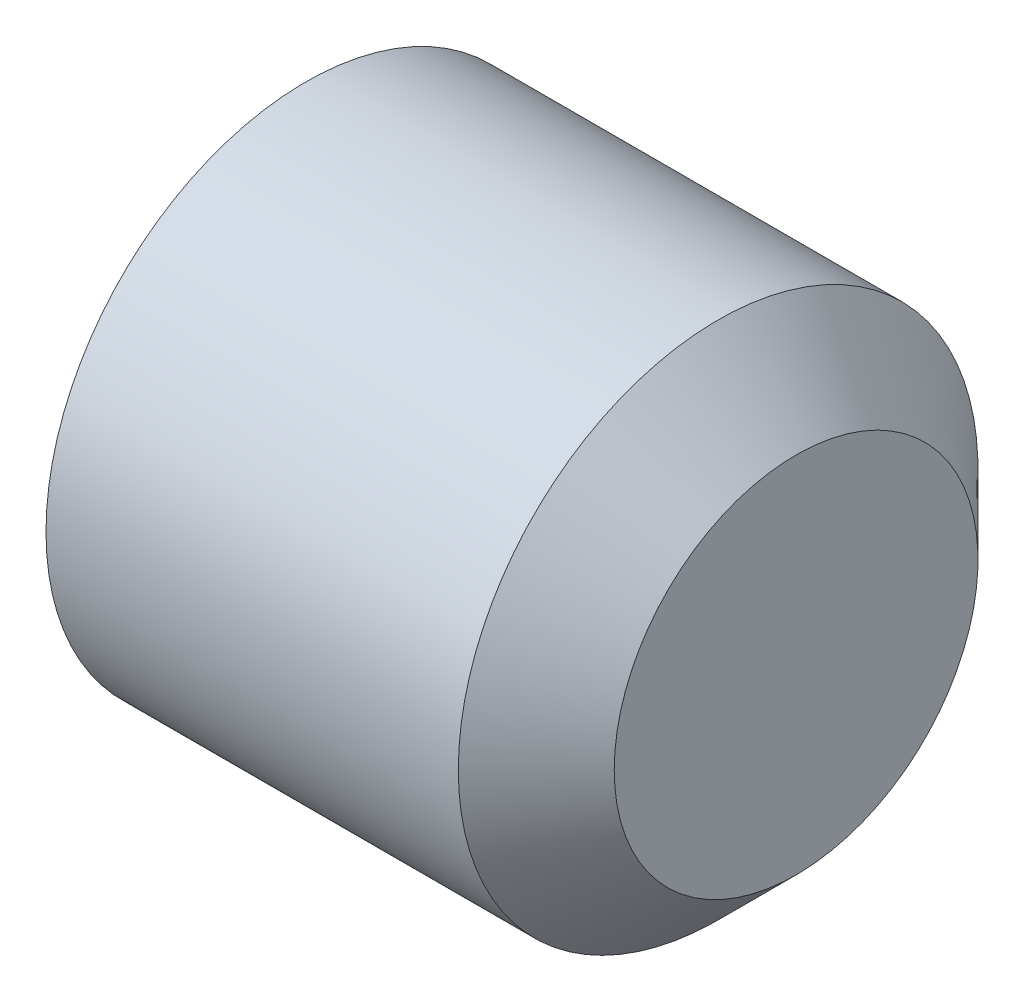
ISO-10303-21;
HEADER;
FILE_DESCRIPTION(('STEP AP214'),'2;1');
FILE_NAME('part.step','',(''),(''),'','','');
FILE_SCHEMA(('AUTOMOTIVE_DESIGN { 1 0 10303 214 1 1 1 1 }'));
ENDSEC;
DATA;
#1=APPLICATION_CONTEXT('core data for automotive mechanical design processes');
#2=APPLICATION_PROTOCOL_DEFINITION('international standard','automotive_design',2000,#1);
#3=PRODUCT_CONTEXT('',#1,'mechanical');
#4=PRODUCT('Part','Part','',(#3));
#5=PRODUCT_RELATED_PRODUCT_CATEGORY('part','',(#4));
#6=PRODUCT_DEFINITION_FORMATION('','',#4);
#7=PRODUCT_DEFINITION_CONTEXT('part definition',#1,'design');
#8=PRODUCT_DEFINITION('design','',#6,#7);
#9=PRODUCT_DEFINITION_SHAPE('','',#8);
#10=(LENGTH_UNIT() NAMED_UNIT(*) SI_UNIT(.MILLI.,.METRE.));
#11=(NAMED_UNIT(*) PLANE_ANGLE_UNIT() SI_UNIT($,.RADIAN.));
#12=(NAMED_UNIT(*) SI_UNIT($,.STERADIAN.) SOLID_ANGLE_UNIT());
#13=UNCERTAINTY_MEASURE_WITH_UNIT(LENGTH_MEASURE(1.E-05),#10,'distance_accuracy_value','');
#14=(GEOMETRIC_REPRESENTATION_CONTEXT(3) GLOBAL_UNCERTAINTY_ASSIGNED_CONTEXT((#13)) GLOBAL_UNIT_ASSIGNED_CONTEXT((#10,
#11,#12)) REPRESENTATION_CONTEXT('',''));
#15=CARTESIAN_POINT('',(0.,0.,0.));
#16=DIRECTION('',(0.,0.,1.));
#17=DIRECTION('',(1.,0.,0.));
#18=AXIS2_PLACEMENT_3D('',#15,#16,#17);
#19=CARTESIAN_POINT('',(0.83333333333333,0.,0.));
#20=DIRECTION('',(-1.,0.,0.));
#21=DIRECTION('',(0.,0.,1.));
#22=AXIS2_PLACEMENT_3D('',#19,#20,#21);
#23=CONICAL_SURFACE('',#22,0.,1.04719755119661);
#24=CARTESIAN_POINT('',(0.,0.,0.));
#25=DIRECTION('',(-1.,0.,0.));
#26=DIRECTION('',(0.,0.,1.));
#27=AXIS2_PLACEMENT_3D('',#24,#25,#26);
#28=CIRCLE('',#27,1.4433756729741);
#29=CARTESIAN_POINT('',(0.,0.,1.4433756729741));
#30=VERTEX_POINT('',#29);
#31=CARTESIAN_POINT('',(0.,1.25000000000003,0.721687836487051));
#32=VERTEX_POINT('',#31);
#33=EDGE_CURVE('E142',#30,#32,#28,.T.);
#34=ORIENTED_EDGE('',*,*,#33,.T.);
#35=CARTESIAN_POINT('',(-6.66746660219313E-05,1.25020000000002,0.721572366433221));
#36=CARTESIAN_POINT('',(0.0182540852363146,1.19526669476825,0.753288124996257));
#37=CARTESIAN_POINT('',(0.0349166937993671,1.13985921349977,0.78527764922173));
#38=CARTESIAN_POINT('',(0.0640026960542333,1.02808463239967,0.849810733708432));
#39=CARTESIAN_POINT('',(0.0764157980239526,0.971715545158301,0.882355441401211));
#40=CARTESIAN_POINT('',(0.0957403123639898,0.859676025913025,0.947041487997347));
#41=CARTESIAN_POINT('',(0.102780310552569,0.804022841540779,0.979172868975923));
#42=CARTESIAN_POINT('',(0.111187567369367,0.692454346091615,1.04358696985658));
#43=CARTESIAN_POINT('',(0.112561784795276,0.636539441062406,1.07586945532691));
#44=CARTESIAN_POINT('',(0.109716662632079,0.532042078818279,1.13620103554816));
#45=CARTESIAN_POINT('',(0.106195901179983,0.483444050118688,1.16425912049995));
#46=CARTESIAN_POINT('',(0.0950328873007429,0.386564637826765,1.22019247526563));
#47=CARTESIAN_POINT('',(0.0873868144273217,0.33828358980784,1.24806755133611));
#48=CARTESIAN_POINT('',(0.0682705452994674,0.241204116145959,1.30411641158758));
#49=CARTESIAN_POINT('',(0.0567192430203415,0.192417989648102,1.33228309485384));
#50=CARTESIAN_POINT('',(0.0305016853061078,0.095573747707899,1.38819614400748));
#51=CARTESIAN_POINT('',(0.0158415978608937,0.0475143896730363,1.41594322730599));
#52=CARTESIAN_POINT('',(-6.66746660267736E-05,-0.000200000000000035,1.44349114302794));
#53=B_SPLINE_CURVE_WITH_KNOTS('',3,(#35,#36,#37,#38,#39,#40,#41,#42,#43,#44,#45,#46,#47,#48,#49,
#50,#51,#52),.UNSPECIFIED.,.F.,.F.,(4,2,2,2,2,2,2,2,4),(0.,0.198150821029562,0.396778196315227,
0.590488617354409,0.783961049317194,0.95248005639866,1.12115539730011,1.29357430343591,
1.46565426976932),.UNSPECIFIED.);
#54=EDGE_CURVE('E11',#32,#30,#53,.T.);
#55=ORIENTED_EDGE('',*,*,#54,.T.);
#56=EDGE_LOOP('',(#34,#55));
#57=FACE_BOUND('',#56,.T.);
#58=ADVANCED_FACE('F43',(#57),#23,.F.);
#59=CARTESIAN_POINT('',(0.,-1.25000000000002,0.721687836487058));
#60=VERTEX_POINT('',#59);
#61=EDGE_CURVE('E141',#60,#30,#28,.T.);
#62=ORIENTED_EDGE('',*,*,#61,.T.);
#63=CARTESIAN_POINT('',(-6.66746660268099E-05,0.000199999999999981,1.44349114302794));
#64=CARTESIAN_POINT('',(0.0182540852363098,-0.0547333052317663,1.4117753844649));
#65=CARTESIAN_POINT('',(0.0349166937993627,-0.110140786500242,1.37978586023943));
#66=CARTESIAN_POINT('',(0.06400269605423,-0.221915367600345,1.31525277575273));
#67=CARTESIAN_POINT('',(0.0764157980239499,-0.278284454841716,1.28270806805995));
#68=CARTESIAN_POINT('',(0.0957403123639879,-0.390323974086993,1.21802202146381));
#69=CARTESIAN_POINT('',(0.102780310552568,-0.445977158459239,1.18589064048523));
#70=CARTESIAN_POINT('',(0.111187567369366,-0.557545653908403,1.12147653960458));
#71=CARTESIAN_POINT('',(0.112561784795275,-0.613460558937613,1.08919405413425));
#72=CARTESIAN_POINT('',(0.10971666263208,-0.717957921181739,1.028862473913));
#73=CARTESIAN_POINT('',(0.106195901179984,-0.76655594988133,1.0008043889612));
#74=CARTESIAN_POINT('',(0.0950328873007448,-0.863435362173253,0.94487103419553));
#75=CARTESIAN_POINT('',(0.087386814427324,-0.911716410192178,0.916995958125047));
#76=CARTESIAN_POINT('',(0.0682705452994706,-1.00879588385406,0.860947097873573));
#77=CARTESIAN_POINT('',(0.0567192430203451,-1.05758201035191,0.832780414607316));
#78=CARTESIAN_POINT('',(0.0305016853061119,-1.15442625229212,0.776867365453675));
#79=CARTESIAN_POINT('',(0.0158415978608981,-1.20248561032698,0.749120282155167));
#80=CARTESIAN_POINT('',(-6.66746660219481E-05,-1.25020000000002,0.721572366433221));
#81=B_SPLINE_CURVE_WITH_KNOTS('',3,(#63,#64,#65,#66,#67,#68,#69,#70,#71,#72,#73,#74,#75,#76,#77,
#78,#79,#80),.UNSPECIFIED.,.F.,.F.,(4,2,2,2,2,2,2,2,4),(0.,0.198150821029564,0.396778196315229,
0.590488617354412,0.783961049317198,0.952480056398663,1.12115539730011,1.29357430343592,
1.46565426976932),.UNSPECIFIED.);
#82=EDGE_CURVE('E57',#30,#60,#81,.T.);
#83=ORIENTED_EDGE('',*,*,#82,.T.);
#84=EDGE_LOOP('',(#62,#83));
#85=FACE_BOUND('',#84,.T.);
#86=ADVANCED_FACE('F217',(#85),#23,.F.);
#87=CARTESIAN_POINT('',(0.,-1.25000000000002,-0.721687836487002));
#88=VERTEX_POINT('',#87);
#89=EDGE_CURVE('E245',#88,#60,#28,.T.);
#90=ORIENTED_EDGE('',*,*,#89,.T.);
#91=CARTESIAN_POINT('',(-0.723125533725218,-1.25000000000002,2.38855450315372));
#92=CARTESIAN_POINT('',(-0.694512714136866,-1.25000000000002,2.33261400232343));
#93=CARTESIAN_POINT('',(-0.66606638488083,-1.25000000000002,2.27658784489106));
#94=CARTESIAN_POINT('',(-0.609585913438912,-1.25000000000002,2.16432677662066));
#95=CARTESIAN_POINT('',(-0.581551780027691,-1.25000000000002,2.10809186137049));
#96=CARTESIAN_POINT('',(-0.498093498263183,-1.25000000000002,1.93882910957217));
#97=CARTESIAN_POINT('',(-0.443411639249018,-1.25000000000002,1.82543388021049));
#98=CARTESIAN_POINT('',(-0.334298848658163,-1.25000000000002,1.59142958961822));
#99=CARTESIAN_POINT('',(-0.280022481335802,-1.25000000000002,1.47074722047899));
#100=CARTESIAN_POINT('',(-0.202661005486305,-1.25000000000002,1.28803679596571));
#101=CARTESIAN_POINT('',(-0.177555163940496,-1.25000000000002,1.22686777081667));
#102=CARTESIAN_POINT('',(-0.129115153823104,-1.25000000000002,1.10383524784599));
#103=CARTESIAN_POINT('',(-0.105780807369272,-1.25000000000002,1.04197182046975));
#104=CARTESIAN_POINT('',(-0.0574567956154591,-1.25000000000002,0.906290686389106));
#105=CARTESIAN_POINT('',(-0.0329155229053761,-1.25000000000002,0.832310829015467));
#106=CARTESIAN_POINT('',(0.0117528005591605,-1.25000000000002,0.683045282747963));
#107=CARTESIAN_POINT('',(0.0318821801489908,-1.25000000000002,0.607760305524386));
#108=CARTESIAN_POINT('',(0.0658999098953772,-1.25000000000002,0.457227311030485));
#109=CARTESIAN_POINT('',(0.0798975032663708,-1.25000000000002,0.382004714348821));
#110=CARTESIAN_POINT('',(0.100694509672485,-1.25000000000002,0.230574793536791));
#111=CARTESIAN_POINT('',(0.107497972399627,-1.25000000000002,0.154368047882492));
#112=CARTESIAN_POINT('',(0.113017067627266,-1.25000000000002,0.000758127504506175));
#113=CARTESIAN_POINT('',(0.111637545538924,-1.25000000000002,-0.0766486420869878));
#114=CARTESIAN_POINT('',(0.100772950050972,-1.25000000000002,-0.230894929107457));
#115=CARTESIAN_POINT('',(0.0912846749924727,-1.25000000000002,-0.307734210380375));
#116=CARTESIAN_POINT('',(0.0651909747562643,-1.25000000000002,-0.461702943031744));
#117=CARTESIAN_POINT('',(0.0484494878936388,-1.25000000000002,-0.538808478119655));
#118=CARTESIAN_POINT('',(0.00949941464194663,-1.25000000000002,-0.691605492713038));
#119=CARTESIAN_POINT('',(-0.0127104303057358,-1.25000000000002,-0.767296642372799));
#120=CARTESIAN_POINT('',(-0.0591758290557663,-1.25000000000002,-0.91131122625957));
#121=CARTESIAN_POINT('',(-0.0831218497054745,-1.25000000000002,-0.979736466805027));
#122=CARTESIAN_POINT('',(-0.133531682963292,-1.25000000000002,-1.11565965802141));
#123=CARTESIAN_POINT('',(-0.159995993229588,-1.25000000000002,-1.18315742237818));
#124=CARTESIAN_POINT('',(-0.214822951192086,-1.25000000000002,-1.31744060643002));
#125=CARTESIAN_POINT('',(-0.243187240234055,-1.25000000000002,-1.38422535089341));
#126=CARTESIAN_POINT('',(-0.301338794191647,-1.25000000000002,-1.51717422229082));
#127=CARTESIAN_POINT('',(-0.331126152263779,-1.25000000000002,-1.58333830825537));
#128=CARTESIAN_POINT('',(-0.418871668434598,-1.25000000000002,-1.77405787301153));
#129=CARTESIAN_POINT('',(-0.478222830298611,-1.25000000000002,-1.89797140255541));
#130=CARTESIAN_POINT('',(-0.568973030237184,-1.25000000000002,-2.08276459736176));
#131=CARTESIAN_POINT('',(-0.59946560514473,-1.25000000000002,-2.14409605852878));
#132=CARTESIAN_POINT('',(-0.660947546416482,-1.25000000000002,-2.26650353643493));
#133=CARTESIAN_POINT('',(-0.691936873120399,-1.25000000000002,-2.32757957308086));
#134=CARTESIAN_POINT('',(-0.723125533725189,-1.25000000000002,-2.38855450315366));
#135=B_SPLINE_CURVE_WITH_KNOTS('',3,(#91,#92,#93,#94,#95,#96,#97,#98,#99,#100,#101,#102,#103,
#104,#105,#106,#107,#108,#109,#110,#111,#112,#113,#114,#115,#116,#117,#118,#119,#120,#121,#122,
#123,#124,#125,#126,#127,#128,#129,#130,#131,#132,#133,#134),.UNSPECIFIED.,.F.,.F.,(4,2,2,2,2,2,
2,2,2,2,2,2,2,2,2,2,2,2,2,2,2,4),(0.,0.188500396101583,0.377004799132287,0.754656745053071,
1.15153907639069,1.3498805083985,1.54820199780876,1.78193522701242,2.0155447804655,
2.24480392033555,2.47393393772945,2.70573354165869,2.93762471161865,3.17406818753763,
3.41056613256657,3.62798696703794,3.84545085726258,4.06310509441107,4.28077359915012,
4.69290371598787,4.8983831803543,5.10384632030758),.UNSPECIFIED.);
#136=EDGE_CURVE('E191',#60,#88,#135,.T.);
#137=ORIENTED_EDGE('',*,*,#136,.T.);
#138=EDGE_LOOP('',(#90,#137));
#139=FACE_BOUND('',#138,.T.);
#140=ADVANCED_FACE('F223',(#139),#23,.F.);
#141=CARTESIAN_POINT('',(0.,0.,-1.44337567297404));
#142=VERTEX_POINT('',#141);
#143=EDGE_CURVE('E243',#142,#88,#28,.T.);
#144=ORIENTED_EDGE('',*,*,#143,.T.);
#145=CARTESIAN_POINT('',(-6.66746660057022E-05,-1.25020000000002,-0.721572366433164));
#146=CARTESIAN_POINT('',(0.0182540852363312,-1.19526669476825,-0.753288124996199));
#147=CARTESIAN_POINT('',(0.0349166937993845,-1.13985921349978,-0.785277649221672));
#148=CARTESIAN_POINT('',(0.0640026960542528,-1.02808463239968,-0.849810733708372));
#149=CARTESIAN_POINT('',(0.0764157980239733,-0.971715545158308,-0.882355441401151));
#150=CARTESIAN_POINT('',(0.0957403123640127,-0.859676025913034,-0.947041487997285));
#151=CARTESIAN_POINT('',(0.102780310552593,-0.80402284154079,-0.979172868975861));
#152=CARTESIAN_POINT('',(0.111187567369394,-0.692454346091628,-1.04358696985652));
#153=CARTESIAN_POINT('',(0.112561784795304,-0.63653944106242,-1.07586945532684));
#154=CARTESIAN_POINT('',(0.10971666263211,-0.532042078818294,-1.13620103554809));
#155=CARTESIAN_POINT('',(0.106195901180015,-0.483444050118702,-1.16425912049989));
#156=CARTESIAN_POINT('',(0.0950328873007757,-0.386564637826775,-1.22019247526556));
#157=CARTESIAN_POINT('',(0.087386814427355,-0.338283589807849,-1.24806755133605));
#158=CARTESIAN_POINT('',(0.0682705452995012,-0.241204116145966,-1.30411641158752));
#159=CARTESIAN_POINT('',(0.0567192430203753,-0.192417989648107,-1.33228309485378));
#160=CARTESIAN_POINT('',(0.0305016853061413,-0.0955737477079013,-1.38819614400743));
#161=CARTESIAN_POINT('',(0.0158415978609268,-0.0475143896730374,-1.41594322730593));
#162=CARTESIAN_POINT('',(-6.66746659940686E-05,0.000200000000000096,-1.44349114302788));
#163=B_SPLINE_CURVE_WITH_KNOTS('',3,(#145,#146,#147,#148,#149,#150,#151,#152,#153,#154,#155,
#156,#157,#158,#159,#160,#161,#162),.UNSPECIFIED.,.F.,.F.,(4,2,2,2,2,2,2,2,4),(0.,
0.198150821029559,0.396778196315219,0.590488617354397,0.783961049317178,0.952480056398648,
1.1211553973001,1.29357430343591,1.46565426976932),.UNSPECIFIED.);
#164=EDGE_CURVE('E185',#88,#142,#163,.T.);
#165=ORIENTED_EDGE('',*,*,#164,.T.);
#166=EDGE_LOOP('',(#144,#165));
#167=FACE_BOUND('',#166,.T.);
#168=ADVANCED_FACE('F234',(#167),#23,.F.);
#169=CARTESIAN_POINT('',(0.,1.25000000000002,-0.721687836487002));
#170=VERTEX_POINT('',#169);
#171=EDGE_CURVE('E241',#170,#142,#28,.T.);
#172=ORIENTED_EDGE('',*,*,#171,.T.);
#173=CARTESIAN_POINT('',(-6.66746659941212E-05,-0.000199999999999926,-1.44349114302788));
#174=CARTESIAN_POINT('',(0.0182540852363418,0.0547333052317643,-1.41177538446485));
#175=CARTESIAN_POINT('',(0.034916693799394,0.110140786500238,-1.37978586023937));
#176=CARTESIAN_POINT('',(0.0640026960542601,0.221915367600336,-1.31525277575267));
#177=CARTESIAN_POINT('',(0.0764157980239795,0.278284454841706,-1.2827080680599));
#178=CARTESIAN_POINT('',(0.0957403123640169,0.390323974086978,-1.21802202146376));
#179=CARTESIAN_POINT('',(0.102780310552596,0.445977158459222,-1.18589064048519));
#180=CARTESIAN_POINT('',(0.111187567369395,0.557545653908382,-1.12147653960453));
#181=CARTESIAN_POINT('',(0.112561784795304,0.613460558937589,-1.08919405413421));
#182=CARTESIAN_POINT('',(0.109716662632108,0.717957921181716,-1.02886247391296));
#183=CARTESIAN_POINT('',(0.106195901180012,0.766555949881308,-1.00080438896116));
#184=CARTESIAN_POINT('',(0.0950328873007713,0.863435362173236,-0.944871034195484));
#185=CARTESIAN_POINT('',(0.0873868144273497,0.911716410192163,-0.916995958124999));
#186=CARTESIAN_POINT('',(0.0682705452994941,1.00879588385405,-0.860947097873523));
#187=CARTESIAN_POINT('',(0.0567192430203673,1.05758201035191,-0.832780414607265));
#188=CARTESIAN_POINT('',(0.0305016853061314,1.15442625229211,-0.776867365453621));
#189=CARTESIAN_POINT('',(0.015841597860916,1.20248561032698,-0.749120282155111));
#190=CARTESIAN_POINT('',(-6.66746660057401E-05,1.25020000000002,-0.721572366433164));
#191=B_SPLINE_CURVE_WITH_KNOTS('',3,(#173,#174,#175,#176,#177,#178,#179,#180,#181,#182,#183,
#184,#185,#186,#187,#188,#189,#190),.UNSPECIFIED.,.F.,.F.,(4,2,2,2,2,2,2,2,4),(0.,
0.198150821029556,0.396778196315213,0.590488617354389,0.783961049317167,0.952480056398639,
1.1211553973001,1.29357430343591,1.46565426976932),.UNSPECIFIED.);
#192=EDGE_CURVE('E124',#142,#170,#191,.T.);
#193=ORIENTED_EDGE('',*,*,#192,.T.);
#194=EDGE_LOOP('',(#172,#193));
#195=FACE_BOUND('',#194,.T.);
#196=ADVANCED_FACE('F226',(#195),#23,.F.);
#197=EDGE_CURVE('E146',#32,#170,#28,.T.);
#198=ORIENTED_EDGE('',*,*,#197,.T.);
#199=CARTESIAN_POINT('',(-0.72312553372519,1.25000000000002,-2.38855450315366));
#200=CARTESIAN_POINT('',(-0.694512714136838,1.25000000000002,-2.33261400232338));
#201=CARTESIAN_POINT('',(-0.666066384880803,1.25000000000002,-2.27658784489101));
#202=CARTESIAN_POINT('',(-0.609585913438887,1.25000000000002,-2.16432677662061));
#203=CARTESIAN_POINT('',(-0.581551780027666,1.25000000000002,-2.10809186137044));
#204=CARTESIAN_POINT('',(-0.49809349826316,1.25000000000002,-1.93882910957213));
#205=CARTESIAN_POINT('',(-0.443411639248997,1.25000000000002,-1.82543388021045));
#206=CARTESIAN_POINT('',(-0.334298848658144,1.25000000000002,-1.59142958961817));
#207=CARTESIAN_POINT('',(-0.280022481335785,1.25000000000002,-1.47074722047895));
#208=CARTESIAN_POINT('',(-0.20266100548629,1.25000000000002,-1.28803679596567));
#209=CARTESIAN_POINT('',(-0.177555163940482,1.25000000000002,-1.22686777081664));
#210=CARTESIAN_POINT('',(-0.129115153823092,1.25000000000002,-1.10383524784596));
#211=CARTESIAN_POINT('',(-0.105780807369261,1.25000000000002,-1.04197182046972));
#212=CARTESIAN_POINT('',(-0.0574567956154493,1.25000000000002,-0.906290686389077));
#213=CARTESIAN_POINT('',(-0.0329155229053671,1.25000000000002,-0.832310829015439));
#214=CARTESIAN_POINT('',(0.0117528005591679,1.25000000000002,-0.683045282747935));
#215=CARTESIAN_POINT('',(0.0318821801489975,1.25000000000002,-0.607760305524359));
#216=CARTESIAN_POINT('',(0.0658999098953822,1.25000000000002,-0.45722731103046));
#217=CARTESIAN_POINT('',(0.0798975032663748,1.25000000000002,-0.382004714348796));
#218=CARTESIAN_POINT('',(0.100694509672488,1.25000000000002,-0.230574793536767));
#219=CARTESIAN_POINT('',(0.107497972399629,1.25000000000002,-0.154368047882468));
#220=CARTESIAN_POINT('',(0.113017067627266,1.25000000000002,-0.000758127504484545));
#221=CARTESIAN_POINT('',(0.111637545538924,1.25000000000002,0.0766486420870085));
#222=CARTESIAN_POINT('',(0.10077295005097,1.25000000000002,0.230894929107476));
#223=CARTESIAN_POINT('',(0.0912846749924701,1.25000000000002,0.307734210380393));
#224=CARTESIAN_POINT('',(0.0651909747562611,1.25000000000002,0.46170294303176));
#225=CARTESIAN_POINT('',(0.0484494878936356,1.25000000000002,0.53880847811967));
#226=CARTESIAN_POINT('',(0.0094994146419431,1.25000000000002,0.691605492713051));
#227=CARTESIAN_POINT('',(-0.0127104303057395,1.25000000000002,0.767296642372811));
#228=CARTESIAN_POINT('',(-0.0591758290557709,1.25000000000002,0.911311226259583));
#229=CARTESIAN_POINT('',(-0.08312184970548,1.25000000000002,0.979736466805042));
#230=CARTESIAN_POINT('',(-0.1335316829633,1.25000000000002,1.11565965802143));
#231=CARTESIAN_POINT('',(-0.159995993229597,1.25000000000002,1.1831574223782));
#232=CARTESIAN_POINT('',(-0.214822951192096,1.25000000000002,1.31744060643004));
#233=CARTESIAN_POINT('',(-0.243187240234067,1.25000000000002,1.38422535089344));
#234=CARTESIAN_POINT('',(-0.301338794191661,1.25000000000002,1.51717422229085));
#235=CARTESIAN_POINT('',(-0.331126152263794,1.25000000000002,1.5833383082554));
#236=CARTESIAN_POINT('',(-0.418871668434616,1.25000000000002,1.77405787301157));
#237=CARTESIAN_POINT('',(-0.478222830298631,1.25000000000002,1.89797140255546));
#238=CARTESIAN_POINT('',(-0.568973030237207,1.25000000000002,2.0827645973618));
#239=CARTESIAN_POINT('',(-0.599465605144755,1.25000000000002,2.14409605852883));
#240=CARTESIAN_POINT('',(-0.660947546416509,1.25000000000002,2.26650353643498));
#241=CARTESIAN_POINT('',(-0.691936873120427,1.25000000000002,2.32757957308092));
#242=CARTESIAN_POINT('',(-0.723125533725218,1.25000000000002,2.38855450315372));
#243=B_SPLINE_CURVE_WITH_KNOTS('',3,(#199,#200,#201,#202,#203,#204,#205,#206,#207,#208,#209,
#210,#211,#212,#213,#214,#215,#216,#217,#218,#219,#220,#221,#222,#223,#224,#225,#226,#227,#228,
#229,#230,#231,#232,#233,#234,#235,#236,#237,#238,#239,#240,#241,#242),.UNSPECIFIED.,.F.,.F.,(4,
2,2,2,2,2,2,2,2,2,2,2,2,2,2,2,2,2,2,2,2,4),(0.,0.188500396101579,0.377004799132279,
0.754656745053056,1.15153907639067,1.34988050839847,1.54820199780873,1.78193522701238,
2.01554478046546,2.24480392033551,2.47393393772941,2.70573354165865,2.93762471161861,
3.17406818753758,3.41056613256652,3.62798696703789,3.84545085726254,4.06310509441104,
4.28077359915009,4.69290371598786,4.89838318035429,5.10384632030758),.UNSPECIFIED.);
#244=EDGE_CURVE('E90',#170,#32,#243,.T.);
#245=ORIENTED_EDGE('',*,*,#244,.T.);
#246=EDGE_LOOP('',(#198,#245));
#247=FACE_BOUND('',#246,.T.);
#248=ADVANCED_FACE('F219',(#247),#23,.F.);
#249=CARTESIAN_POINT('',(5.,0.,0.));
#250=DIRECTION('',(1.,0.,0.));
#251=DIRECTION('',(0.,0.,-1.));
#252=AXIS2_PLACEMENT_3D('',#249,#250,#251);
#253=PLANE('',#252);
#254=CARTESIAN_POINT('',(5.,0.,0.));
#255=DIRECTION('',(-1.,0.,0.));
#256=DIRECTION('',(0.,0.,1.));
#257=AXIS2_PLACEMENT_3D('',#254,#255,#256);
#258=CIRCLE('',#257,1.75);
#259=CARTESIAN_POINT('',(5.,0.,1.75));
#260=VERTEX_POINT('',#259);
#261=EDGE_CURVE('E155',#260,#260,#258,.T.);
#262=ORIENTED_EDGE('',*,*,#261,.F.);
#263=EDGE_LOOP('',(#262));
#264=FACE_BOUND('',#263,.T.);
#265=ADVANCED_FACE('F45',(#264),#253,.T.);
#266=CARTESIAN_POINT('',(4.25,0.,0.));
#267=DIRECTION('',(-1.,0.,0.));
#268=DIRECTION('',(0.,0.,1.));
#269=AXIS2_PLACEMENT_3D('',#266,#267,#268);
#270=CONICAL_SURFACE('',#269,2.5,0.785398163397449);
#271=ORIENTED_EDGE('',*,*,#261,.T.);
#272=EDGE_LOOP('',(#271));
#273=FACE_BOUND('',#272,.T.);
#274=CARTESIAN_POINT('',(4.25,0.,0.));
#275=DIRECTION('',(-1.,0.,0.));
#276=DIRECTION('',(0.,0.,1.));
#277=AXIS2_PLACEMENT_3D('',#274,#275,#276);
#278=CIRCLE('',#277,2.5);
#279=CARTESIAN_POINT('',(4.25,0.,2.5));
#280=VERTEX_POINT('',#279);
#281=EDGE_CURVE('E152',#280,#280,#278,.T.);
#282=ORIENTED_EDGE('',*,*,#281,.F.);
#283=EDGE_LOOP('',(#282));
#284=FACE_BOUND('',#283,.T.);
#285=ADVANCED_FACE('F232',(#273,#284),#270,.T.);
#286=CARTESIAN_POINT('',(0.83333333333333,0.,0.));
#287=DIRECTION('',(-1.,0.,0.));
#288=DIRECTION('',(0.,0.,1.));
#289=AXIS2_PLACEMENT_3D('',#286,#287,#288);
#290=CYLINDRICAL_SURFACE('',#289,2.5);
#291=ORIENTED_EDGE('',*,*,#281,.T.);
#292=EDGE_LOOP('',(#291));
#293=FACE_BOUND('',#292,.T.);
#294=CARTESIAN_POINT('',(0.28319030703751,0.,0.));
#295=DIRECTION('',(-1.,0.,0.));
#296=DIRECTION('',(0.,0.,1.));
#297=AXIS2_PLACEMENT_3D('',#294,#295,#296);
#298=CIRCLE('',#297,2.5);
#299=CARTESIAN_POINT('',(0.28319030703751,0.,2.5));
#300=VERTEX_POINT('',#299);
#301=EDGE_CURVE('E149',#300,#300,#298,.T.);
#302=ORIENTED_EDGE('',*,*,#301,.F.);
#303=EDGE_LOOP('',(#302));
#304=FACE_BOUND('',#303,.T.);
#305=ADVANCED_FACE('F283',(#293,#304),#290,.T.);
#306=CARTESIAN_POINT('',(0.,0.,0.));
#307=DIRECTION('',(1.,0.,0.));
#308=DIRECTION('',(0.,0.,-1.));
#309=AXIS2_PLACEMENT_3D('',#306,#307,#308);
#310=CONICAL_SURFACE('',#309,2.0095,1.0471975511966);
#311=ORIENTED_EDGE('',*,*,#301,.T.);
#312=EDGE_LOOP('',(#311));
#313=FACE_BOUND('',#312,.T.);
#314=CARTESIAN_POINT('',(0.,0.,0.));
#315=DIRECTION('',(-1.,0.,0.));
#316=DIRECTION('',(0.,0.,1.));
#317=AXIS2_PLACEMENT_3D('',#314,#315,#316);
#318=CIRCLE('',#317,2.0095);
#319=CARTESIAN_POINT('',(0.,0.,2.0095));
#320=VERTEX_POINT('',#319);
#321=EDGE_CURVE('E145',#320,#320,#318,.T.);
#322=ORIENTED_EDGE('',*,*,#321,.F.);
#323=EDGE_LOOP('',(#322));
#324=FACE_BOUND('',#323,.T.);
#325=ADVANCED_FACE('F214',(#313,#324),#310,.T.);
#326=CARTESIAN_POINT('',(0.,-2.0095,0.));
#327=DIRECTION('',(-1.,0.,0.));
#328=DIRECTION('',(0.,0.,1.));
#329=AXIS2_PLACEMENT_3D('',#326,#327,#328);
#330=PLANE('',#329);
#331=ORIENTED_EDGE('',*,*,#321,.T.);
#332=EDGE_LOOP('',(#331));
#333=FACE_BOUND('',#332,.T.);
#334=ORIENTED_EDGE('',*,*,#33,.F.);
#335=ORIENTED_EDGE('',*,*,#61,.F.);
#336=ORIENTED_EDGE('',*,*,#89,.F.);
#337=ORIENTED_EDGE('',*,*,#143,.F.);
#338=ORIENTED_EDGE('',*,*,#171,.F.);
#339=ORIENTED_EDGE('',*,*,#197,.F.);
#340=EDGE_LOOP('',(#334,#335,#336,#337,#338,#339));
#341=FACE_BOUND('',#340,.T.);
#342=ADVANCED_FACE('F209',(#333,#341),#330,.T.);
#343=CARTESIAN_POINT('',(2.,1.25000000000002,0.721687836487058));
#344=DIRECTION('',(0.,-0.5,-0.866025403784439));
#345=DIRECTION('',(0.,0.866025403784439,-0.5));
#346=AXIS2_PLACEMENT_3D('',#343,#344,#345);
#347=PLANE('',#346);
#348=DIRECTION('',(-1.,0.,0.));
#349=VECTOR('',#348,1.);
#350=CARTESIAN_POINT('',(2.,1.25000000000002,0.721687836487058));
#351=LINE('',#350,#349);
#352=CARTESIAN_POINT('',(2.,1.25000000000002,0.721687836487058));
#353=VERTEX_POINT('',#352);
#354=EDGE_CURVE('E64',#353,#32,#351,.T.);
#355=ORIENTED_EDGE('',*,*,#354,.F.);
#356=DIRECTION('',(0.,-0.866025403784439,0.5));
#357=VECTOR('',#356,1.);
#358=CARTESIAN_POINT('',(2.,1.25000000000002,0.721687836487058));
#359=LINE('',#358,#357);
#360=CARTESIAN_POINT('',(2.,0.,1.4433756729741));
#361=VERTEX_POINT('',#360);
#362=EDGE_CURVE('E254',#353,#361,#359,.T.);
#363=ORIENTED_EDGE('',*,*,#362,.T.);
#364=DIRECTION('',(-1.,0.,0.));
#365=VECTOR('',#364,1.);
#366=CARTESIAN_POINT('',(2.,0.,1.4433756729741));
#367=LINE('',#366,#365);
#368=EDGE_CURVE('E138',#361,#30,#367,.T.);
#369=ORIENTED_EDGE('',*,*,#368,.T.);
#370=ORIENTED_EDGE('',*,*,#54,.F.);
#371=EDGE_LOOP('',(#355,#363,#369,#370));
#372=FACE_BOUND('',#371,.T.);
#373=ADVANCED_FACE('F205',(#372),#347,.T.);
#374=CARTESIAN_POINT('',(2.,0.,1.4433756729741));
#375=DIRECTION('',(0.,0.5,-0.866025403784439));
#376=DIRECTION('',(0.,0.866025403784439,0.5));
#377=AXIS2_PLACEMENT_3D('',#374,#375,#376);
#378=PLANE('',#377);
#379=ORIENTED_EDGE('',*,*,#368,.F.);
#380=DIRECTION('',(0.,-0.866025403784439,-0.5));
#381=VECTOR('',#380,1.);
#382=CARTESIAN_POINT('',(2.,0.,1.4433756729741));
#383=LINE('',#382,#381);
#384=CARTESIAN_POINT('',(2.,-1.25000000000002,0.721687836487058));
#385=VERTEX_POINT('',#384);
#386=EDGE_CURVE('E99',#361,#385,#383,.T.);
#387=ORIENTED_EDGE('',*,*,#386,.T.);
#388=DIRECTION('',(-1.,0.,0.));
#389=VECTOR('',#388,1.);
#390=CARTESIAN_POINT('',(2.,-1.25000000000002,0.721687836487058));
#391=LINE('',#390,#389);
#392=EDGE_CURVE('E135',#385,#60,#391,.T.);
#393=ORIENTED_EDGE('',*,*,#392,.T.);
#394=ORIENTED_EDGE('',*,*,#82,.F.);
#395=EDGE_LOOP('',(#379,#387,#393,#394));
#396=FACE_BOUND('',#395,.T.);
#397=ADVANCED_FACE('F202',(#396),#378,.T.);
#398=CARTESIAN_POINT('',(2.,-1.25000000000002,0.721687836487058));
#399=DIRECTION('',(0.,1.,0.));
#400=DIRECTION('',(0.,0.,1.));
#401=AXIS2_PLACEMENT_3D('',#398,#399,#400);
#402=PLANE('',#401);
#403=ORIENTED_EDGE('',*,*,#392,.F.);
#404=DIRECTION('',(0.,0.,-1.));
#405=VECTOR('',#404,1.);
#406=CARTESIAN_POINT('',(2.,-1.25000000000002,0.721687836487058));
#407=LINE('',#406,#405);
#408=CARTESIAN_POINT('',(2.,-1.25000000000002,-0.721687836487002));
#409=VERTEX_POINT('',#408);
#410=EDGE_CURVE('E119',#385,#409,#407,.T.);
#411=ORIENTED_EDGE('',*,*,#410,.T.);
#412=DIRECTION('',(-1.,0.,0.));
#413=VECTOR('',#412,1.);
#414=CARTESIAN_POINT('',(2.,-1.25000000000002,-0.721687836487002));
#415=LINE('',#414,#413);
#416=EDGE_CURVE('E116',#409,#88,#415,.T.);
#417=ORIENTED_EDGE('',*,*,#416,.T.);
#418=ORIENTED_EDGE('',*,*,#136,.F.);
#419=EDGE_LOOP('',(#403,#411,#417,#418));
#420=FACE_BOUND('',#419,.T.);
#421=ADVANCED_FACE('F182',(#420),#402,.T.);
#422=CARTESIAN_POINT('',(2.,-1.25000000000002,-0.721687836487002));
#423=DIRECTION('',(0.,0.5,0.866025403784439));
#424=DIRECTION('',(0.,-0.866025403784439,0.5));
#425=AXIS2_PLACEMENT_3D('',#422,#423,#424);
#426=PLANE('',#425);
#427=ORIENTED_EDGE('',*,*,#416,.F.);
#428=DIRECTION('',(0.,0.866025403784439,-0.5));
#429=VECTOR('',#428,1.);
#430=CARTESIAN_POINT('',(2.,-1.25000000000002,-0.721687836487002));
#431=LINE('',#430,#429);
#432=CARTESIAN_POINT('',(2.,0.,-1.44337567297404));
#433=VERTEX_POINT('',#432);
#434=EDGE_CURVE('E110',#409,#433,#431,.T.);
#435=ORIENTED_EDGE('',*,*,#434,.T.);
#436=DIRECTION('',(-1.,0.,0.));
#437=VECTOR('',#436,1.);
#438=CARTESIAN_POINT('',(2.,0.,-1.44337567297404));
#439=LINE('',#438,#437);
#440=EDGE_CURVE('E113',#433,#142,#439,.T.);
#441=ORIENTED_EDGE('',*,*,#440,.T.);
#442=ORIENTED_EDGE('',*,*,#164,.F.);
#443=EDGE_LOOP('',(#427,#435,#441,#442));
#444=FACE_BOUND('',#443,.T.);
#445=ADVANCED_FACE('F112',(#444),#426,.T.);
#446=CARTESIAN_POINT('',(2.,0.,-1.44337567297404));
#447=DIRECTION('',(0.,-0.5,0.866025403784439));
#448=DIRECTION('',(0.,-0.866025403784439,-0.5));
#449=AXIS2_PLACEMENT_3D('',#446,#447,#448);
#450=PLANE('',#449);
#451=ORIENTED_EDGE('',*,*,#440,.F.);
#452=DIRECTION('',(0.,0.866025403784439,0.5));
#453=VECTOR('',#452,1.);
#454=CARTESIAN_POINT('',(2.,0.,-1.44337567297404));
#455=LINE('',#454,#453);
#456=CARTESIAN_POINT('',(2.,1.25000000000002,-0.721687836487002));
#457=VERTEX_POINT('',#456);
#458=EDGE_CURVE('E118',#433,#457,#455,.T.);
#459=ORIENTED_EDGE('',*,*,#458,.T.);
#460=DIRECTION('',(-1.,0.,0.));
#461=VECTOR('',#460,1.);
#462=CARTESIAN_POINT('',(2.,1.25000000000002,-0.721687836487002));
#463=LINE('',#462,#461);
#464=EDGE_CURVE('E125',#457,#170,#463,.T.);
#465=ORIENTED_EDGE('',*,*,#464,.T.);
#466=ORIENTED_EDGE('',*,*,#192,.F.);
#467=EDGE_LOOP('',(#451,#459,#465,#466));
#468=FACE_BOUND('',#467,.T.);
#469=ADVANCED_FACE('F122',(#468),#450,.T.);
#470=CARTESIAN_POINT('',(2.,1.25000000000002,-0.721687836487002));
#471=DIRECTION('',(0.,-1.,0.));
#472=DIRECTION('',(0.,0.,-1.));
#473=AXIS2_PLACEMENT_3D('',#470,#471,#472);
#474=PLANE('',#473);
#475=ORIENTED_EDGE('',*,*,#464,.F.);
#476=DIRECTION('',(0.,0.,1.));
#477=VECTOR('',#476,1.);
#478=CARTESIAN_POINT('',(2.,1.25000000000002,-0.721687836487002));
#479=LINE('',#478,#477);
#480=EDGE_CURVE('E70',#457,#353,#479,.T.);
#481=ORIENTED_EDGE('',*,*,#480,.T.);
#482=ORIENTED_EDGE('',*,*,#354,.T.);
#483=ORIENTED_EDGE('',*,*,#244,.F.);
#484=EDGE_LOOP('',(#475,#481,#482,#483));
#485=FACE_BOUND('',#484,.T.);
#486=ADVANCED_FACE('F172',(#485),#474,.T.);
#487=CARTESIAN_POINT('',(2.,0.,0.));
#488=DIRECTION('',(1.,0.,0.));
#489=DIRECTION('',(0.,0.,-1.));
#490=AXIS2_PLACEMENT_3D('',#487,#488,#489);
#491=PLANE('',#490);
#492=ORIENTED_EDGE('',*,*,#362,.F.);
#493=ORIENTED_EDGE('',*,*,#480,.F.);
#494=ORIENTED_EDGE('',*,*,#458,.F.);
#495=ORIENTED_EDGE('',*,*,#434,.F.);
#496=ORIENTED_EDGE('',*,*,#410,.F.);
#497=ORIENTED_EDGE('',*,*,#386,.F.);
#498=EDGE_LOOP('',(#492,#493,#494,#495,#496,#497));
#499=FACE_BOUND('',#498,.T.);
#500=ADVANCED_FACE('F127',(#499),#491,.F.);
#501=CLOSED_SHELL('',(#58,#86,#140,#168,#196,#248,#265,#285,#305,#325,#342,#373,#397,#421,#445,
#469,#486,#500));
#502=MANIFOLD_SOLID_BREP('B2',#501);
#503=ADVANCED_BREP_SHAPE_REPRESENTATION('',(#18,#502),#14);
#504=SHAPE_DEFINITION_REPRESENTATION(#9,#503);
ENDSEC;
END-ISO-10303-21;
